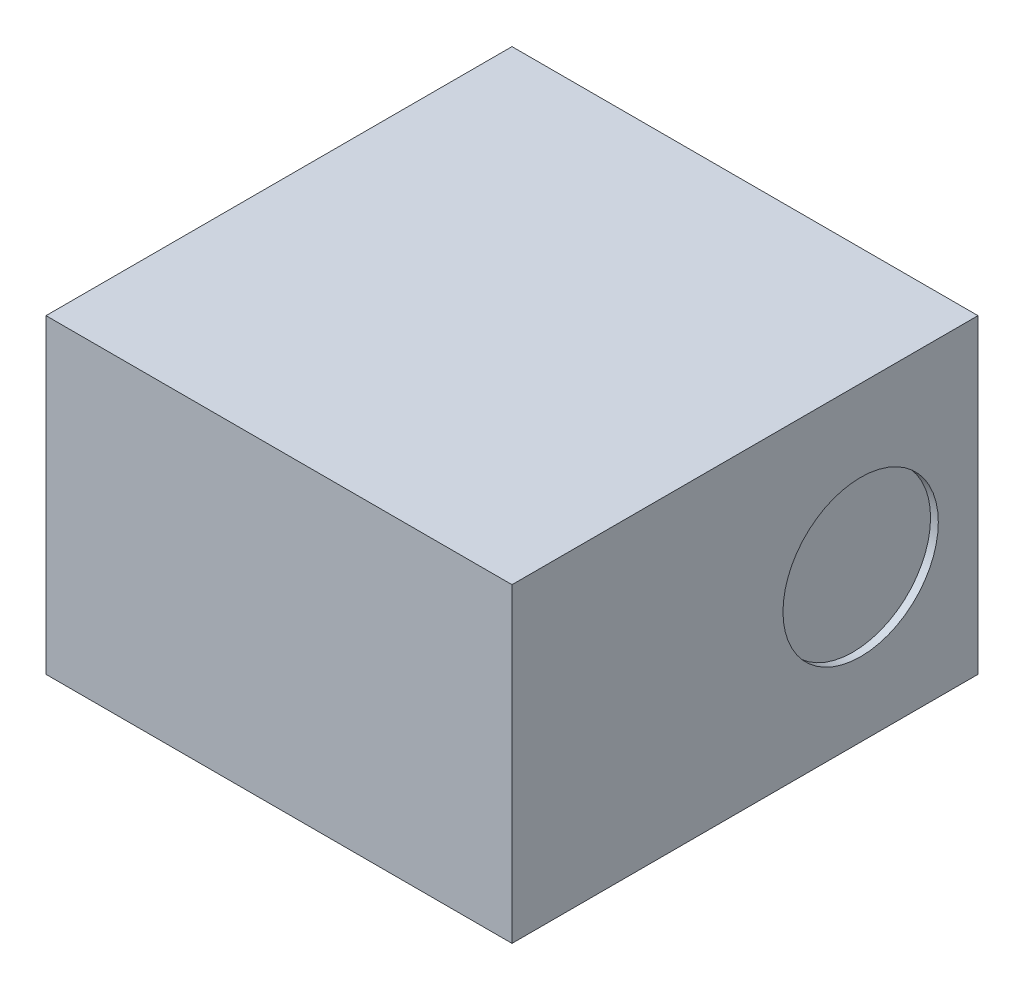
ISO-10303-21;
HEADER;
FILE_DESCRIPTION(('STEP AP214'),'2;1');
FILE_NAME('part.step','',(''),(''),'','','');
FILE_SCHEMA(('AUTOMOTIVE_DESIGN { 1 0 10303 214 1 1 1 1 }'));
ENDSEC;
DATA;
#1=APPLICATION_CONTEXT('core data for automotive mechanical design processes');
#2=APPLICATION_PROTOCOL_DEFINITION('international standard','automotive_design',2000,#1);
#3=PRODUCT_CONTEXT('',#1,'mechanical');
#4=PRODUCT('Part','Part','',(#3));
#5=PRODUCT_RELATED_PRODUCT_CATEGORY('part','',(#4));
#6=PRODUCT_DEFINITION_FORMATION('','',#4);
#7=PRODUCT_DEFINITION_CONTEXT('part definition',#1,'design');
#8=PRODUCT_DEFINITION('design','',#6,#7);
#9=PRODUCT_DEFINITION_SHAPE('','',#8);
#10=(LENGTH_UNIT() NAMED_UNIT(*) SI_UNIT(.MILLI.,.METRE.));
#11=(NAMED_UNIT(*) PLANE_ANGLE_UNIT() SI_UNIT($,.RADIAN.));
#12=(NAMED_UNIT(*) SI_UNIT($,.STERADIAN.) SOLID_ANGLE_UNIT());
#13=UNCERTAINTY_MEASURE_WITH_UNIT(LENGTH_MEASURE(1.E-05),#10,'distance_accuracy_value','');
#14=(GEOMETRIC_REPRESENTATION_CONTEXT(3) GLOBAL_UNCERTAINTY_ASSIGNED_CONTEXT((#13)) GLOBAL_UNIT_ASSIGNED_CONTEXT((#10,
#11,#12)) REPRESENTATION_CONTEXT('',''));
#15=CARTESIAN_POINT('',(0.,0.,0.));
#16=DIRECTION('',(0.,0.,1.));
#17=DIRECTION('',(1.,0.,0.));
#18=AXIS2_PLACEMENT_3D('',#15,#16,#17);
#19=CARTESIAN_POINT('',(-1.5,2.,-1.5));
#20=DIRECTION('',(1.,0.,0.));
#21=DIRECTION('',(0.,0.,-1.));
#22=AXIS2_PLACEMENT_3D('',#19,#20,#21);
#23=PLANE('',#22);
#24=DIRECTION('',(0.,0.,1.));
#25=VECTOR('',#24,1.);
#26=CARTESIAN_POINT('',(-1.5,0.,-1.5));
#27=LINE('',#26,#25);
#28=CARTESIAN_POINT('',(-1.5,0.,-1.5));
#29=VERTEX_POINT('',#28);
#30=CARTESIAN_POINT('',(-1.5,0.,1.5));
#31=VERTEX_POINT('',#30);
#32=EDGE_CURVE('E97',#29,#31,#27,.T.);
#33=ORIENTED_EDGE('',*,*,#32,.T.);
#34=DIRECTION('',(0.,-1.,0.));
#35=VECTOR('',#34,1.);
#36=CARTESIAN_POINT('',(-1.5,2.,1.5));
#37=LINE('',#36,#35);
#38=CARTESIAN_POINT('',(-1.5,2.,1.5));
#39=VERTEX_POINT('',#38);
#40=EDGE_CURVE('E11',#39,#31,#37,.T.);
#41=ORIENTED_EDGE('',*,*,#40,.F.);
#42=DIRECTION('',(0.,0.,1.));
#43=VECTOR('',#42,1.);
#44=CARTESIAN_POINT('',(-1.5,2.,-1.5));
#45=LINE('',#44,#43);
#46=CARTESIAN_POINT('',(-1.5,2.,-1.5));
#47=VERTEX_POINT('',#46);
#48=EDGE_CURVE('E85',#47,#39,#45,.T.);
#49=ORIENTED_EDGE('',*,*,#48,.F.);
#50=DIRECTION('',(0.,-1.,0.));
#51=VECTOR('',#50,1.);
#52=CARTESIAN_POINT('',(-1.5,2.,-1.5));
#53=LINE('',#52,#51);
#54=EDGE_CURVE('E93',#47,#29,#53,.T.);
#55=ORIENTED_EDGE('',*,*,#54,.T.);
#56=EDGE_LOOP('',(#33,#41,#49,#55));
#57=FACE_BOUND('',#56,.T.);
#58=ADVANCED_FACE('F34',(#57),#23,.F.);
#59=CARTESIAN_POINT('',(-1.5,2.,1.5));
#60=DIRECTION('',(0.,0.,-1.));
#61=DIRECTION('',(-1.,0.,0.));
#62=AXIS2_PLACEMENT_3D('',#59,#60,#61);
#63=PLANE('',#62);
#64=DIRECTION('',(1.,0.,0.));
#65=VECTOR('',#64,1.);
#66=CARTESIAN_POINT('',(-1.5,0.,1.5));
#67=LINE('',#66,#65);
#68=CARTESIAN_POINT('',(1.5,0.,1.5));
#69=VERTEX_POINT('',#68);
#70=EDGE_CURVE('E89',#31,#69,#67,.T.);
#71=ORIENTED_EDGE('',*,*,#70,.T.);
#72=DIRECTION('',(0.,-1.,0.));
#73=VECTOR('',#72,1.);
#74=CARTESIAN_POINT('',(1.5,2.,1.5));
#75=LINE('',#74,#73);
#76=CARTESIAN_POINT('',(1.5,2.,1.5));
#77=VERTEX_POINT('',#76);
#78=EDGE_CURVE('E42',#77,#69,#75,.T.);
#79=ORIENTED_EDGE('',*,*,#78,.F.);
#80=DIRECTION('',(1.,0.,0.));
#81=VECTOR('',#80,1.);
#82=CARTESIAN_POINT('',(-1.5,2.,1.5));
#83=LINE('',#82,#81);
#84=EDGE_CURVE('E80',#39,#77,#83,.T.);
#85=ORIENTED_EDGE('',*,*,#84,.F.);
#86=ORIENTED_EDGE('',*,*,#40,.T.);
#87=EDGE_LOOP('',(#71,#79,#85,#86));
#88=FACE_BOUND('',#87,.T.);
#89=ADVANCED_FACE('F88',(#88),#63,.F.);
#90=CARTESIAN_POINT('',(1.5,2.,-1.5));
#91=DIRECTION('',(-1.,0.,0.));
#92=DIRECTION('',(0.,0.,1.));
#93=AXIS2_PLACEMENT_3D('',#90,#91,#92);
#94=PLANE('',#93);
#95=CARTESIAN_POINT('',(1.5,0.976289457581985,-0.744511031925999));
#96=DIRECTION('',(1.,0.,0.));
#97=DIRECTION('',(0.,0.,-1.));
#98=AXIS2_PLACEMENT_3D('',#95,#96,#97);
#99=CIRCLE('',#98,0.5);
#100=CARTESIAN_POINT('',(1.5,0.976289457581985,-1.244511031926));
#101=VERTEX_POINT('',#100);
#102=EDGE_CURVE('E111',#101,#101,#99,.T.);
#103=ORIENTED_EDGE('',*,*,#102,.F.);
#104=EDGE_LOOP('',(#103));
#105=FACE_BOUND('',#104,.T.);
#106=DIRECTION('',(0.,0.,-1.));
#107=VECTOR('',#106,1.);
#108=CARTESIAN_POINT('',(1.5,0.,-1.5));
#109=LINE('',#108,#107);
#110=CARTESIAN_POINT('',(1.5,0.,-1.5));
#111=VERTEX_POINT('',#110);
#112=EDGE_CURVE('E67',#69,#111,#109,.T.);
#113=ORIENTED_EDGE('',*,*,#112,.T.);
#114=DIRECTION('',(0.,-1.,0.));
#115=VECTOR('',#114,1.);
#116=CARTESIAN_POINT('',(1.5,2.,-1.5));
#117=LINE('',#116,#115);
#118=CARTESIAN_POINT('',(1.5,2.,-1.5));
#119=VERTEX_POINT('',#118);
#120=EDGE_CURVE('E90',#119,#111,#117,.T.);
#121=ORIENTED_EDGE('',*,*,#120,.F.);
#122=DIRECTION('',(0.,0.,-1.));
#123=VECTOR('',#122,1.);
#124=CARTESIAN_POINT('',(1.5,2.,-1.5));
#125=LINE('',#124,#123);
#126=EDGE_CURVE('E83',#77,#119,#125,.T.);
#127=ORIENTED_EDGE('',*,*,#126,.F.);
#128=ORIENTED_EDGE('',*,*,#78,.T.);
#129=EDGE_LOOP('',(#113,#121,#127,#128));
#130=FACE_BOUND('',#129,.T.);
#131=ADVANCED_FACE('F91',(#105,#130),#94,.F.);
#132=CARTESIAN_POINT('',(-1.5,2.,-1.5));
#133=DIRECTION('',(0.,0.,1.));
#134=DIRECTION('',(1.,0.,0.));
#135=AXIS2_PLACEMENT_3D('',#132,#133,#134);
#136=PLANE('',#135);
#137=DIRECTION('',(-1.,0.,0.));
#138=VECTOR('',#137,1.);
#139=CARTESIAN_POINT('',(-1.5,0.,-1.5));
#140=LINE('',#139,#138);
#141=EDGE_CURVE('E73',#111,#29,#140,.T.);
#142=ORIENTED_EDGE('',*,*,#141,.T.);
#143=ORIENTED_EDGE('',*,*,#54,.F.);
#144=DIRECTION('',(-1.,0.,0.));
#145=VECTOR('',#144,1.);
#146=CARTESIAN_POINT('',(-1.5,2.,-1.5));
#147=LINE('',#146,#145);
#148=EDGE_CURVE('E50',#119,#47,#147,.T.);
#149=ORIENTED_EDGE('',*,*,#148,.F.);
#150=ORIENTED_EDGE('',*,*,#120,.T.);
#151=EDGE_LOOP('',(#142,#143,#149,#150));
#152=FACE_BOUND('',#151,.T.);
#153=ADVANCED_FACE('F105',(#152),#136,.F.);
#154=CARTESIAN_POINT('',(0.,2.,0.));
#155=DIRECTION('',(0.,1.,0.));
#156=DIRECTION('',(0.,0.,1.));
#157=AXIS2_PLACEMENT_3D('',#154,#155,#156);
#158=PLANE('',#157);
#159=ORIENTED_EDGE('',*,*,#48,.T.);
#160=ORIENTED_EDGE('',*,*,#84,.T.);
#161=ORIENTED_EDGE('',*,*,#126,.T.);
#162=ORIENTED_EDGE('',*,*,#148,.T.);
#163=EDGE_LOOP('',(#159,#160,#161,#162));
#164=FACE_BOUND('',#163,.T.);
#165=ADVANCED_FACE('F81',(#164),#158,.T.);
#166=CARTESIAN_POINT('',(0.,0.,0.));
#167=DIRECTION('',(0.,1.,0.));
#168=DIRECTION('',(0.,0.,1.));
#169=AXIS2_PLACEMENT_3D('',#166,#167,#168);
#170=PLANE('',#169);
#171=ORIENTED_EDGE('',*,*,#32,.F.);
#172=ORIENTED_EDGE('',*,*,#141,.F.);
#173=ORIENTED_EDGE('',*,*,#112,.F.);
#174=ORIENTED_EDGE('',*,*,#70,.F.);
#175=EDGE_LOOP('',(#171,#172,#173,#174));
#176=FACE_BOUND('',#175,.T.);
#177=ADVANCED_FACE('F108',(#176),#170,.F.);
#178=CARTESIAN_POINT('',(1.45,0.976289457581985,-0.744511031925999));
#179=DIRECTION('',(1.,0.,0.));
#180=DIRECTION('',(0.,0.,-1.));
#181=AXIS2_PLACEMENT_3D('',#178,#179,#180);
#182=CYLINDRICAL_SURFACE('',#181,0.5);
#183=CARTESIAN_POINT('',(1.45,0.976289457581985,-0.744511031925999));
#184=DIRECTION('',(1.,0.,0.));
#185=DIRECTION('',(0.,0.,-1.));
#186=AXIS2_PLACEMENT_3D('',#183,#184,#185);
#187=CIRCLE('',#186,0.5);
#188=CARTESIAN_POINT('',(1.45,0.976289457581985,-1.244511031926));
#189=VERTEX_POINT('',#188);
#190=EDGE_CURVE('E100',#189,#189,#187,.T.);
#191=ORIENTED_EDGE('',*,*,#190,.F.);
#192=EDGE_LOOP('',(#191));
#193=FACE_BOUND('',#192,.T.);
#194=ORIENTED_EDGE('',*,*,#102,.T.);
#195=EDGE_LOOP('',(#194));
#196=FACE_BOUND('',#195,.T.);
#197=ADVANCED_FACE('F119',(#193,#196),#182,.F.);
#198=CARTESIAN_POINT('',(1.45,0.976289457581985,-0.744511031925999));
#199=DIRECTION('',(1.,0.,0.));
#200=DIRECTION('',(0.,0.,-1.));
#201=AXIS2_PLACEMENT_3D('',#198,#199,#200);
#202=PLANE('',#201);
#203=ORIENTED_EDGE('',*,*,#190,.T.);
#204=EDGE_LOOP('',(#203));
#205=FACE_BOUND('',#204,.T.);
#206=ADVANCED_FACE('F117',(#205),#202,.T.);
#207=CLOSED_SHELL('',(#58,#89,#131,#153,#165,#177,#197,#206));
#208=MANIFOLD_SOLID_BREP('B2',#207);
#209=ADVANCED_BREP_SHAPE_REPRESENTATION('',(#18,#208),#14);
#210=SHAPE_DEFINITION_REPRESENTATION(#9,#209);
ENDSEC;
END-ISO-10303-21;
